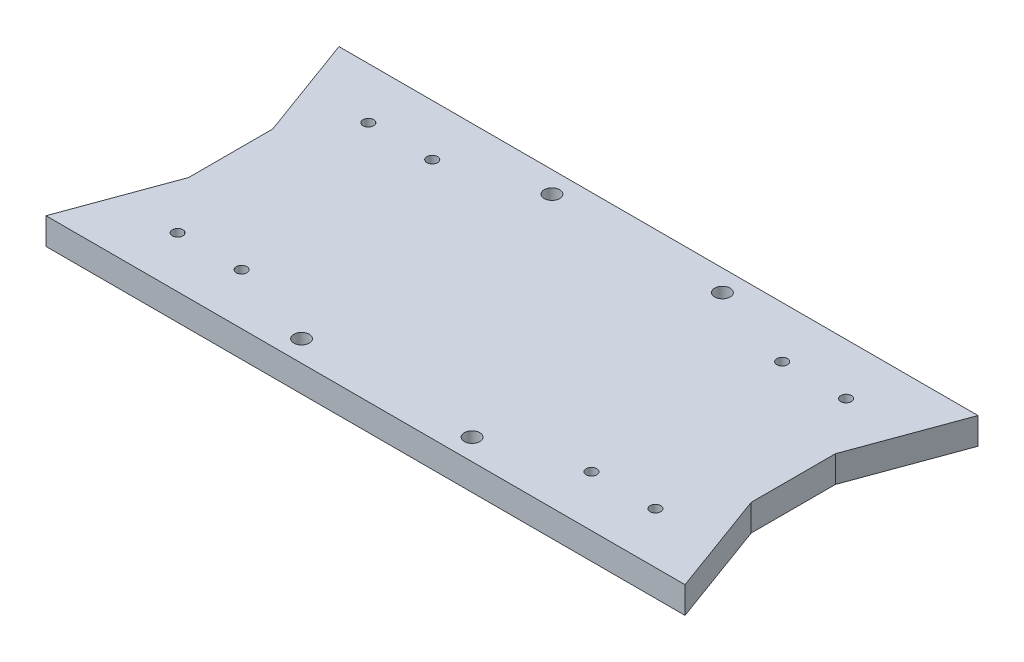
ISO-10303-21;
HEADER;
FILE_DESCRIPTION(('STEP AP214'),'2;1');
FILE_NAME('part.step','',(''),(''),'','','');
FILE_SCHEMA(('AUTOMOTIVE_DESIGN { 1 0 10303 214 1 1 1 1 }'));
ENDSEC;
DATA;
#1=APPLICATION_CONTEXT('core data for automotive mechanical design processes');
#2=APPLICATION_PROTOCOL_DEFINITION('international standard','automotive_design',2000,#1);
#3=PRODUCT_CONTEXT('',#1,'mechanical');
#4=PRODUCT('Part','Part','',(#3));
#5=PRODUCT_RELATED_PRODUCT_CATEGORY('part','',(#4));
#6=PRODUCT_DEFINITION_FORMATION('','',#4);
#7=PRODUCT_DEFINITION_CONTEXT('part definition',#1,'design');
#8=PRODUCT_DEFINITION('design','',#6,#7);
#9=PRODUCT_DEFINITION_SHAPE('','',#8);
#10=(LENGTH_UNIT() NAMED_UNIT(*) SI_UNIT(.MILLI.,.METRE.));
#11=(NAMED_UNIT(*) PLANE_ANGLE_UNIT() SI_UNIT($,.RADIAN.));
#12=(NAMED_UNIT(*) SI_UNIT($,.STERADIAN.) SOLID_ANGLE_UNIT());
#13=UNCERTAINTY_MEASURE_WITH_UNIT(LENGTH_MEASURE(1.E-05),#10,'distance_accuracy_value','');
#14=(GEOMETRIC_REPRESENTATION_CONTEXT(3) GLOBAL_UNCERTAINTY_ASSIGNED_CONTEXT((#13)) GLOBAL_UNIT_ASSIGNED_CONTEXT((#10,
#11,#12)) REPRESENTATION_CONTEXT('',''));
#15=CARTESIAN_POINT('',(0.,0.,0.));
#16=DIRECTION('',(0.,0.,1.));
#17=DIRECTION('',(1.,0.,0.));
#18=AXIS2_PLACEMENT_3D('',#15,#16,#17);
#19=CARTESIAN_POINT('',(-105.394952442636,6.35,-32.7826613509761));
#20=DIRECTION('',(-1.,0.,0.));
#21=DIRECTION('',(0.,0.,1.));
#22=AXIS2_PLACEMENT_3D('',#19,#20,#21);
#23=PLANE('',#22);
#24=DIRECTION('',(0.,0.,1.));
#25=VECTOR('',#24,1.);
#26=CARTESIAN_POINT('',(-105.394952442636,6.35,-32.7826613509761));
#27=LINE('',#26,#25);
#28=CARTESIAN_POINT('',(-105.394952442636,6.35,-77.7376613569761));
#29=VERTEX_POINT('',#28);
#30=CARTESIAN_POINT('',(-105.394952442636,6.35,-57.6776613449761));
#31=VERTEX_POINT('',#30);
#32=EDGE_CURVE('E99',#29,#31,#27,.T.);
#33=ORIENTED_EDGE('',*,*,#32,.F.);
#34=DIRECTION('',(0.,1.,0.));
#35=VECTOR('',#34,1.);
#36=CARTESIAN_POINT('',(-105.394952442636,0.,-77.7376613569761));
#37=LINE('',#36,#35);
#38=CARTESIAN_POINT('',(-105.394952442636,0.,-77.7376613569761));
#39=VERTEX_POINT('',#38);
#40=EDGE_CURVE('E128',#39,#29,#37,.T.);
#41=ORIENTED_EDGE('',*,*,#40,.F.);
#42=DIRECTION('',(0.,0.,-1.));
#43=VECTOR('',#42,1.);
#44=CARTESIAN_POINT('',(-105.394952442636,0.,-32.7826613509761));
#45=LINE('',#44,#43);
#46=CARTESIAN_POINT('',(-105.394952442636,0.,-57.6776613449761));
#47=VERTEX_POINT('',#46);
#48=EDGE_CURVE('E51',#47,#39,#45,.T.);
#49=ORIENTED_EDGE('',*,*,#48,.F.);
#50=DIRECTION('',(0.,1.,0.));
#51=VECTOR('',#50,1.);
#52=CARTESIAN_POINT('',(-105.394952442636,0.,-57.6776613449761));
#53=LINE('',#52,#51);
#54=EDGE_CURVE('E110',#47,#31,#53,.T.);
#55=ORIENTED_EDGE('',*,*,#54,.T.);
#56=EDGE_LOOP('',(#33,#41,#49,#55));
#57=FACE_BOUND('',#56,.T.);
#58=ADVANCED_FACE('F34',(#57),#23,.T.);
#59=CARTESIAN_POINT('',(0.,6.35,0.));
#60=DIRECTION('',(0.,-1.,0.));
#61=DIRECTION('',(0.,0.,-1.));
#62=AXIS2_PLACEMENT_3D('',#59,#60,#61);
#63=PLANE('',#62);
#64=CARTESIAN_POINT('',(-58.653665481045,6.35,-37.8626613509761));
#65=DIRECTION('',(0.,1.,0.));
#66=DIRECTION('',(0.,0.,1.));
#67=AXIS2_PLACEMENT_3D('',#64,#65,#66);
#68=CIRCLE('',#67,1.8415);
#69=CARTESIAN_POINT('',(-58.653665481045,6.35,-36.0211613509761));
#70=VERTEX_POINT('',#69);
#71=EDGE_CURVE('E446',#70,#70,#68,.T.);
#72=ORIENTED_EDGE('',*,*,#71,.F.);
#73=EDGE_LOOP('',(#72));
#74=FACE_BOUND('',#73,.T.);
#75=CARTESIAN_POINT('',(-18.013665481045,6.35,-37.8626613509761));
#76=DIRECTION('',(0.,1.,0.));
#77=DIRECTION('',(0.,0.,1.));
#78=AXIS2_PLACEMENT_3D('',#75,#76,#77);
#79=CIRCLE('',#78,1.8415);
#80=CARTESIAN_POINT('',(-18.013665481045,6.35,-36.0211613509761));
#81=VERTEX_POINT('',#80);
#82=EDGE_CURVE('E443',#81,#81,#79,.T.);
#83=ORIENTED_EDGE('',*,*,#82,.F.);
#84=EDGE_LOOP('',(#83));
#85=FACE_BOUND('',#84,.T.);
#86=CARTESIAN_POINT('',(-18.0136654810451,6.35,-97.552661350976));
#87=DIRECTION('',(0.,1.,0.));
#88=DIRECTION('',(0.,0.,1.));
#89=AXIS2_PLACEMENT_3D('',#86,#87,#88);
#90=CIRCLE('',#89,1.84149999999999);
#91=CARTESIAN_POINT('',(-18.0136654810451,6.35,-95.711161350976));
#92=VERTEX_POINT('',#91);
#93=EDGE_CURVE('E445',#92,#92,#90,.T.);
#94=ORIENTED_EDGE('',*,*,#93,.F.);
#95=EDGE_LOOP('',(#94));
#96=FACE_BOUND('',#95,.T.);
#97=CARTESIAN_POINT('',(-58.6536654810451,6.35,-97.552661350976));
#98=DIRECTION('',(0.,1.,0.));
#99=DIRECTION('',(0.,0.,1.));
#100=AXIS2_PLACEMENT_3D('',#97,#98,#99);
#101=CIRCLE('',#100,1.84149999999999);
#102=CARTESIAN_POINT('',(-58.6536654810451,6.35,-95.711161350976));
#103=VERTEX_POINT('',#102);
#104=EDGE_CURVE('E215',#103,#103,#101,.T.);
#105=ORIENTED_EDGE('',*,*,#104,.F.);
#106=EDGE_LOOP('',(#105));
#107=FACE_BOUND('',#106,.T.);
#108=ORIENTED_EDGE('',*,*,#32,.T.);
#109=DIRECTION('',(0.343774305183413,0.,-0.939052302641158));
#110=VECTOR('',#109,1.);
#111=CARTESIAN_POINT('',(-105.394952442636,6.35,-57.6776613449761));
#112=LINE('',#111,#110);
#113=CARTESIAN_POINT('',(-114.508674118636,6.35,-32.7826613509761));
#114=VERTEX_POINT('',#113);
#115=EDGE_CURVE('E103',#114,#31,#112,.T.);
#116=ORIENTED_EDGE('',*,*,#115,.F.);
#117=DIRECTION('',(1.,0.,0.));
#118=VECTOR('',#117,1.);
#119=CARTESIAN_POINT('',(-38.3336654810452,6.35,-32.7826613509761));
#120=LINE('',#119,#118);
#121=CARTESIAN_POINT('',(37.8413431565453,6.35,-32.7826613509761));
#122=VERTEX_POINT('',#121);
#123=EDGE_CURVE('E43',#114,#122,#120,.T.);
#124=ORIENTED_EDGE('',*,*,#123,.T.);
#125=DIRECTION('',(-0.343774305183413,0.,-0.939052302641158));
#126=VECTOR('',#125,1.);
#127=CARTESIAN_POINT('',(28.7276214805453,6.35,-57.6776613449761));
#128=LINE('',#127,#126);
#129=CARTESIAN_POINT('',(28.7276214805453,6.35,-57.6776613449761));
#130=VERTEX_POINT('',#129);
#131=EDGE_CURVE('E157',#122,#130,#128,.T.);
#132=ORIENTED_EDGE('',*,*,#131,.T.);
#133=DIRECTION('',(0.,0.,1.));
#134=VECTOR('',#133,1.);
#135=CARTESIAN_POINT('',(28.7276214805453,6.35,-32.7826613509761));
#136=LINE('',#135,#134);
#137=CARTESIAN_POINT('',(28.7276214805453,6.35,-77.7376613569761));
#138=VERTEX_POINT('',#137);
#139=EDGE_CURVE('E107',#138,#130,#136,.T.);
#140=ORIENTED_EDGE('',*,*,#139,.F.);
#141=DIRECTION('',(0.343774305183414,0.,-0.939052302641158));
#142=VECTOR('',#141,1.);
#143=CARTESIAN_POINT('',(37.8413431565453,6.35,-102.632661350976));
#144=LINE('',#143,#142);
#145=CARTESIAN_POINT('',(37.8413431565453,6.35,-102.632661350976));
#146=VERTEX_POINT('',#145);
#147=EDGE_CURVE('E166',#138,#146,#144,.T.);
#148=ORIENTED_EDGE('',*,*,#147,.T.);
#149=DIRECTION('',(-1.,0.,0.));
#150=VECTOR('',#149,1.);
#151=CARTESIAN_POINT('',(-38.3336654810452,6.35,-102.632661350976));
#152=LINE('',#151,#150);
#153=CARTESIAN_POINT('',(-114.508674118636,6.35,-102.632661350976));
#154=VERTEX_POINT('',#153);
#155=EDGE_CURVE('E11',#146,#154,#152,.T.);
#156=ORIENTED_EDGE('',*,*,#155,.T.);
#157=DIRECTION('',(-0.343774305183414,0.,-0.939052302641158));
#158=VECTOR('',#157,1.);
#159=CARTESIAN_POINT('',(-114.508674118636,6.35,-102.632661350976));
#160=LINE('',#159,#158);
#161=EDGE_CURVE('E105',#29,#154,#160,.T.);
#162=ORIENTED_EDGE('',*,*,#161,.F.);
#163=EDGE_LOOP('',(#108,#116,#124,#132,#140,#148,#156,#162));
#164=FACE_BOUND('',#163,.T.);
#165=CARTESIAN_POINT('',(18.6213431565454,6.35,-44.9476613509761));
#166=DIRECTION('',(0.,1.,0.));
#167=DIRECTION('',(0.,0.,1.));
#168=AXIS2_PLACEMENT_3D('',#165,#166,#167);
#169=CIRCLE('',#168,1.27);
#170=CARTESIAN_POINT('',(18.6213431565454,6.35,-43.6776613509761));
#171=VERTEX_POINT('',#170);
#172=EDGE_CURVE('E181',#171,#171,#169,.T.);
#173=ORIENTED_EDGE('',*,*,#172,.F.);
#174=EDGE_LOOP('',(#173));
#175=FACE_BOUND('',#174,.T.);
#176=CARTESIAN_POINT('',(3.38134315654538,6.35,-44.9476613509761));
#177=DIRECTION('',(0.,1.,0.));
#178=DIRECTION('',(0.,0.,1.));
#179=AXIS2_PLACEMENT_3D('',#176,#177,#178);
#180=CIRCLE('',#179,1.27);
#181=CARTESIAN_POINT('',(3.38134315654538,6.35,-43.6776613509761));
#182=VERTEX_POINT('',#181);
#183=EDGE_CURVE('E187',#182,#182,#180,.T.);
#184=ORIENTED_EDGE('',*,*,#183,.F.);
#185=EDGE_LOOP('',(#184));
#186=FACE_BOUND('',#185,.T.);
#187=CARTESIAN_POINT('',(18.6213431565454,6.35,-90.4076613509761));
#188=DIRECTION('',(0.,1.,0.));
#189=DIRECTION('',(0.,0.,1.));
#190=AXIS2_PLACEMENT_3D('',#187,#188,#189);
#191=CIRCLE('',#190,1.27000000000001);
#192=CARTESIAN_POINT('',(18.6213431565454,6.35,-89.137661350976));
#193=VERTEX_POINT('',#192);
#194=EDGE_CURVE('E193',#193,#193,#191,.T.);
#195=ORIENTED_EDGE('',*,*,#194,.F.);
#196=EDGE_LOOP('',(#195));
#197=FACE_BOUND('',#196,.T.);
#198=CARTESIAN_POINT('',(3.38134315654538,6.35,-90.4076613509761));
#199=DIRECTION('',(0.,1.,0.));
#200=DIRECTION('',(0.,0.,1.));
#201=AXIS2_PLACEMENT_3D('',#198,#199,#200);
#202=CIRCLE('',#201,1.27000000000001);
#203=CARTESIAN_POINT('',(3.38134315654538,6.35,-89.137661350976));
#204=VERTEX_POINT('',#203);
#205=EDGE_CURVE('E199',#204,#204,#202,.T.);
#206=ORIENTED_EDGE('',*,*,#205,.F.);
#207=EDGE_LOOP('',(#206));
#208=FACE_BOUND('',#207,.T.);
#209=CARTESIAN_POINT('',(-95.2886741186358,6.35,-44.9476613509761));
#210=DIRECTION('',(0.,-1.,0.));
#211=DIRECTION('',(0.,0.,1.));
#212=AXIS2_PLACEMENT_3D('',#209,#210,#211);
#213=CIRCLE('',#212,1.27);
#214=CARTESIAN_POINT('',(-95.2886741186358,6.35,-43.6776613509761));
#215=VERTEX_POINT('',#214);
#216=EDGE_CURVE('E133',#215,#215,#213,.T.);
#217=ORIENTED_EDGE('',*,*,#216,.T.);
#218=EDGE_LOOP('',(#217));
#219=FACE_BOUND('',#218,.T.);
#220=CARTESIAN_POINT('',(-80.0486741186358,6.35,-44.9476613509761));
#221=DIRECTION('',(0.,-1.,0.));
#222=DIRECTION('',(0.,0.,1.));
#223=AXIS2_PLACEMENT_3D('',#220,#221,#222);
#224=CIRCLE('',#223,1.27);
#225=CARTESIAN_POINT('',(-80.0486741186358,6.35,-43.6776613509761));
#226=VERTEX_POINT('',#225);
#227=EDGE_CURVE('E139',#226,#226,#224,.T.);
#228=ORIENTED_EDGE('',*,*,#227,.T.);
#229=EDGE_LOOP('',(#228));
#230=FACE_BOUND('',#229,.T.);
#231=CARTESIAN_POINT('',(-95.2886741186358,6.35,-90.4076613509761));
#232=DIRECTION('',(0.,-1.,0.));
#233=DIRECTION('',(0.,0.,1.));
#234=AXIS2_PLACEMENT_3D('',#231,#232,#233);
#235=CIRCLE('',#234,1.27000000000001);
#236=CARTESIAN_POINT('',(-95.2886741186358,6.35,-89.137661350976));
#237=VERTEX_POINT('',#236);
#238=EDGE_CURVE('E145',#237,#237,#235,.T.);
#239=ORIENTED_EDGE('',*,*,#238,.T.);
#240=EDGE_LOOP('',(#239));
#241=FACE_BOUND('',#240,.T.);
#242=CARTESIAN_POINT('',(-80.0486741186358,6.35,-90.4076613509761));
#243=DIRECTION('',(0.,-1.,0.));
#244=DIRECTION('',(0.,0.,1.));
#245=AXIS2_PLACEMENT_3D('',#242,#243,#244);
#246=CIRCLE('',#245,1.27000000000001);
#247=CARTESIAN_POINT('',(-80.0486741186358,6.35,-89.137661350976));
#248=VERTEX_POINT('',#247);
#249=EDGE_CURVE('E151',#248,#248,#246,.T.);
#250=ORIENTED_EDGE('',*,*,#249,.T.);
#251=EDGE_LOOP('',(#250));
#252=FACE_BOUND('',#251,.T.);
#253=ADVANCED_FACE('F100',(#74,#85,#96,#107,#164,#175,#186,#197,#208,#219,#230,#241,#252),#63,.F.);
#254=CARTESIAN_POINT('',(0.,0.,0.));
#255=DIRECTION('',(0.,-1.,0.));
#256=DIRECTION('',(0.,0.,-1.));
#257=AXIS2_PLACEMENT_3D('',#254,#255,#256);
#258=PLANE('',#257);
#259=CARTESIAN_POINT('',(-58.653665481045,0.,-37.8626613509761));
#260=DIRECTION('',(0.,-1.,0.));
#261=DIRECTION('',(0.,0.,-1.));
#262=AXIS2_PLACEMENT_3D('',#259,#260,#261);
#263=CIRCLE('',#262,1.8415);
#264=CARTESIAN_POINT('',(-58.653665481045,0.,-39.7041613509761));
#265=VERTEX_POINT('',#264);
#266=EDGE_CURVE('E38',#265,#265,#263,.T.);
#267=ORIENTED_EDGE('',*,*,#266,.F.);
#268=EDGE_LOOP('',(#267));
#269=FACE_BOUND('',#268,.T.);
#270=CARTESIAN_POINT('',(-18.013665481045,0.,-37.8626613509761));
#271=DIRECTION('',(0.,-1.,0.));
#272=DIRECTION('',(0.,0.,-1.));
#273=AXIS2_PLACEMENT_3D('',#270,#271,#272);
#274=CIRCLE('',#273,1.8415);
#275=CARTESIAN_POINT('',(-18.013665481045,0.,-39.7041613509761));
#276=VERTEX_POINT('',#275);
#277=EDGE_CURVE('E217',#276,#276,#274,.T.);
#278=ORIENTED_EDGE('',*,*,#277,.F.);
#279=EDGE_LOOP('',(#278));
#280=FACE_BOUND('',#279,.T.);
#281=CARTESIAN_POINT('',(-18.0136654810451,0.,-97.552661350976));
#282=DIRECTION('',(0.,-1.,0.));
#283=DIRECTION('',(0.,0.,-1.));
#284=AXIS2_PLACEMENT_3D('',#281,#282,#283);
#285=CIRCLE('',#284,1.84149999999999);
#286=CARTESIAN_POINT('',(-18.0136654810451,0.,-99.394161350976));
#287=VERTEX_POINT('',#286);
#288=EDGE_CURVE('E214',#287,#287,#285,.T.);
#289=ORIENTED_EDGE('',*,*,#288,.F.);
#290=EDGE_LOOP('',(#289));
#291=FACE_BOUND('',#290,.T.);
#292=CARTESIAN_POINT('',(-58.6536654810451,0.,-97.552661350976));
#293=DIRECTION('',(0.,-1.,0.));
#294=DIRECTION('',(0.,0.,-1.));
#295=AXIS2_PLACEMENT_3D('',#292,#293,#294);
#296=CIRCLE('',#295,1.84149999999999);
#297=CARTESIAN_POINT('',(-58.6536654810451,0.,-99.394161350976));
#298=VERTEX_POINT('',#297);
#299=EDGE_CURVE('E211',#298,#298,#296,.T.);
#300=ORIENTED_EDGE('',*,*,#299,.F.);
#301=EDGE_LOOP('',(#300));
#302=FACE_BOUND('',#301,.T.);
#303=CARTESIAN_POINT('',(3.38134315654538,0.,-44.9476613509761));
#304=DIRECTION('',(0.,1.,0.));
#305=DIRECTION('',(0.,0.,1.));
#306=AXIS2_PLACEMENT_3D('',#303,#304,#305);
#307=CIRCLE('',#306,1.27);
#308=CARTESIAN_POINT('',(3.38134315654538,0.,-43.6776613509761));
#309=VERTEX_POINT('',#308);
#310=EDGE_CURVE('E184',#309,#309,#307,.T.);
#311=ORIENTED_EDGE('',*,*,#310,.T.);
#312=EDGE_LOOP('',(#311));
#313=FACE_BOUND('',#312,.T.);
#314=CARTESIAN_POINT('',(3.38134315654538,0.,-90.4076613509761));
#315=DIRECTION('',(0.,1.,0.));
#316=DIRECTION('',(0.,0.,1.));
#317=AXIS2_PLACEMENT_3D('',#314,#315,#316);
#318=CIRCLE('',#317,1.27000000000001);
#319=CARTESIAN_POINT('',(3.38134315654538,0.,-89.137661350976));
#320=VERTEX_POINT('',#319);
#321=EDGE_CURVE('E196',#320,#320,#318,.T.);
#322=ORIENTED_EDGE('',*,*,#321,.T.);
#323=EDGE_LOOP('',(#322));
#324=FACE_BOUND('',#323,.T.);
#325=DIRECTION('',(1.,0.,0.));
#326=VECTOR('',#325,1.);
#327=CARTESIAN_POINT('',(-38.3336654810452,0.,-32.7826613509761));
#328=LINE('',#327,#326);
#329=CARTESIAN_POINT('',(-114.508674118636,0.,-32.7826613509761));
#330=VERTEX_POINT('',#329);
#331=CARTESIAN_POINT('',(37.8413431565453,0.,-32.7826613509761));
#332=VERTEX_POINT('',#331);
#333=EDGE_CURVE('E202',#330,#332,#328,.T.);
#334=ORIENTED_EDGE('',*,*,#333,.F.);
#335=DIRECTION('',(0.343774305183413,0.,-0.939052302641158));
#336=VECTOR('',#335,1.);
#337=CARTESIAN_POINT('',(-105.394952442636,0.,-57.6776613449761));
#338=LINE('',#337,#336);
#339=EDGE_CURVE('E114',#330,#47,#338,.T.);
#340=ORIENTED_EDGE('',*,*,#339,.T.);
#341=ORIENTED_EDGE('',*,*,#48,.T.);
#342=DIRECTION('',(-0.343774305183414,0.,-0.939052302641158));
#343=VECTOR('',#342,1.);
#344=CARTESIAN_POINT('',(-114.508674118636,0.,-102.632661350976));
#345=LINE('',#344,#343);
#346=CARTESIAN_POINT('',(-114.508674118636,0.,-102.632661350976));
#347=VERTEX_POINT('',#346);
#348=EDGE_CURVE('E124',#39,#347,#345,.T.);
#349=ORIENTED_EDGE('',*,*,#348,.T.);
#350=DIRECTION('',(-1.,0.,0.));
#351=VECTOR('',#350,1.);
#352=CARTESIAN_POINT('',(-38.3336654810452,0.,-102.632661350976));
#353=LINE('',#352,#351);
#354=CARTESIAN_POINT('',(37.8413431565453,0.,-102.632661350976));
#355=VERTEX_POINT('',#354);
#356=EDGE_CURVE('E205',#355,#347,#353,.T.);
#357=ORIENTED_EDGE('',*,*,#356,.F.);
#358=DIRECTION('',(0.343774305183414,0.,-0.939052302641158));
#359=VECTOR('',#358,1.);
#360=CARTESIAN_POINT('',(37.8413431565453,0.,-102.632661350976));
#361=LINE('',#360,#359);
#362=CARTESIAN_POINT('',(28.7276214805453,0.,-77.7376613569761));
#363=VERTEX_POINT('',#362);
#364=EDGE_CURVE('E169',#363,#355,#361,.T.);
#365=ORIENTED_EDGE('',*,*,#364,.F.);
#366=DIRECTION('',(0.,0.,-1.));
#367=VECTOR('',#366,1.);
#368=CARTESIAN_POINT('',(28.7276214805453,0.,-32.7826613509761));
#369=LINE('',#368,#367);
#370=CARTESIAN_POINT('',(28.7276214805453,0.,-57.6776613449761));
#371=VERTEX_POINT('',#370);
#372=EDGE_CURVE('E208',#371,#363,#369,.T.);
#373=ORIENTED_EDGE('',*,*,#372,.F.);
#374=DIRECTION('',(-0.343774305183413,0.,-0.939052302641158));
#375=VECTOR('',#374,1.);
#376=CARTESIAN_POINT('',(28.7276214805453,0.,-57.6776613449761));
#377=LINE('',#376,#375);
#378=EDGE_CURVE('E158',#332,#371,#377,.T.);
#379=ORIENTED_EDGE('',*,*,#378,.F.);
#380=EDGE_LOOP('',(#334,#340,#341,#349,#357,#365,#373,#379));
#381=FACE_BOUND('',#380,.T.);
#382=CARTESIAN_POINT('',(18.6213431565454,0.,-90.4076613509761));
#383=DIRECTION('',(0.,1.,0.));
#384=DIRECTION('',(0.,0.,1.));
#385=AXIS2_PLACEMENT_3D('',#382,#383,#384);
#386=CIRCLE('',#385,1.27000000000001);
#387=CARTESIAN_POINT('',(18.6213431565454,0.,-89.137661350976));
#388=VERTEX_POINT('',#387);
#389=EDGE_CURVE('E190',#388,#388,#386,.T.);
#390=ORIENTED_EDGE('',*,*,#389,.T.);
#391=EDGE_LOOP('',(#390));
#392=FACE_BOUND('',#391,.T.);
#393=CARTESIAN_POINT('',(18.6213431565454,0.,-44.9476613509761));
#394=DIRECTION('',(0.,1.,0.));
#395=DIRECTION('',(0.,0.,1.));
#396=AXIS2_PLACEMENT_3D('',#393,#394,#395);
#397=CIRCLE('',#396,1.27);
#398=CARTESIAN_POINT('',(18.6213431565454,0.,-43.6776613509761));
#399=VERTEX_POINT('',#398);
#400=EDGE_CURVE('E178',#399,#399,#397,.T.);
#401=ORIENTED_EDGE('',*,*,#400,.T.);
#402=EDGE_LOOP('',(#401));
#403=FACE_BOUND('',#402,.T.);
#404=CARTESIAN_POINT('',(-95.2886741186358,0.,-44.9476613509761));
#405=DIRECTION('',(0.,-1.,0.));
#406=DIRECTION('',(0.,0.,1.));
#407=AXIS2_PLACEMENT_3D('',#404,#405,#406);
#408=CIRCLE('',#407,1.27);
#409=CARTESIAN_POINT('',(-95.2886741186358,0.,-43.6776613509761));
#410=VERTEX_POINT('',#409);
#411=EDGE_CURVE('E130',#410,#410,#408,.T.);
#412=ORIENTED_EDGE('',*,*,#411,.F.);
#413=EDGE_LOOP('',(#412));
#414=FACE_BOUND('',#413,.T.);
#415=CARTESIAN_POINT('',(-80.0486741186358,0.,-44.9476613509761));
#416=DIRECTION('',(0.,-1.,0.));
#417=DIRECTION('',(0.,0.,1.));
#418=AXIS2_PLACEMENT_3D('',#415,#416,#417);
#419=CIRCLE('',#418,1.27);
#420=CARTESIAN_POINT('',(-80.0486741186358,0.,-43.6776613509761));
#421=VERTEX_POINT('',#420);
#422=EDGE_CURVE('E136',#421,#421,#419,.T.);
#423=ORIENTED_EDGE('',*,*,#422,.F.);
#424=EDGE_LOOP('',(#423));
#425=FACE_BOUND('',#424,.T.);
#426=CARTESIAN_POINT('',(-95.2886741186358,0.,-90.4076613509761));
#427=DIRECTION('',(0.,-1.,0.));
#428=DIRECTION('',(0.,0.,1.));
#429=AXIS2_PLACEMENT_3D('',#426,#427,#428);
#430=CIRCLE('',#429,1.27000000000001);
#431=CARTESIAN_POINT('',(-95.2886741186358,0.,-89.137661350976));
#432=VERTEX_POINT('',#431);
#433=EDGE_CURVE('E142',#432,#432,#430,.T.);
#434=ORIENTED_EDGE('',*,*,#433,.F.);
#435=EDGE_LOOP('',(#434));
#436=FACE_BOUND('',#435,.T.);
#437=CARTESIAN_POINT('',(-80.0486741186358,0.,-90.4076613509761));
#438=DIRECTION('',(0.,-1.,0.));
#439=DIRECTION('',(0.,0.,1.));
#440=AXIS2_PLACEMENT_3D('',#437,#438,#439);
#441=CIRCLE('',#440,1.27000000000001);
#442=CARTESIAN_POINT('',(-80.0486741186358,0.,-89.137661350976));
#443=VERTEX_POINT('',#442);
#444=EDGE_CURVE('E148',#443,#443,#441,.T.);
#445=ORIENTED_EDGE('',*,*,#444,.F.);
#446=EDGE_LOOP('',(#445));
#447=FACE_BOUND('',#446,.T.);
#448=ADVANCED_FACE('F227',(#269,#280,#291,#302,#313,#324,#381,#392,#403,#414,#425,#436,#447),
#258,.T.);
#449=CARTESIAN_POINT('',(-38.3336654810452,6.35,-32.7826613509761));
#450=DIRECTION('',(0.,0.,-1.));
#451=DIRECTION('',(-1.,0.,0.));
#452=AXIS2_PLACEMENT_3D('',#449,#450,#451);
#453=PLANE('',#452);
#454=ORIENTED_EDGE('',*,*,#333,.T.);
#455=DIRECTION('',(0.,1.,0.));
#456=VECTOR('',#455,1.);
#457=CARTESIAN_POINT('',(37.8413431565453,0.,-32.7826613509761));
#458=LINE('',#457,#456);
#459=EDGE_CURVE('E160',#332,#122,#458,.T.);
#460=ORIENTED_EDGE('',*,*,#459,.T.);
#461=ORIENTED_EDGE('',*,*,#123,.F.);
#462=DIRECTION('',(0.,1.,0.));
#463=VECTOR('',#462,1.);
#464=CARTESIAN_POINT('',(-114.508674118636,0.,-32.7826613509761));
#465=LINE('',#464,#463);
#466=EDGE_CURVE('E113',#330,#114,#465,.T.);
#467=ORIENTED_EDGE('',*,*,#466,.F.);
#468=EDGE_LOOP('',(#454,#460,#461,#467));
#469=FACE_BOUND('',#468,.T.);
#470=ADVANCED_FACE('F36',(#469),#453,.F.);
#471=CARTESIAN_POINT('',(28.7276214805453,6.35,-32.7826613509761));
#472=DIRECTION('',(-1.,0.,0.));
#473=DIRECTION('',(0.,0.,1.));
#474=AXIS2_PLACEMENT_3D('',#471,#472,#473);
#475=PLANE('',#474);
#476=DIRECTION('',(0.,1.,0.));
#477=VECTOR('',#476,1.);
#478=CARTESIAN_POINT('',(28.7276214805453,0.,-77.7376613569761));
#479=LINE('',#478,#477);
#480=EDGE_CURVE('E172',#363,#138,#479,.T.);
#481=ORIENTED_EDGE('',*,*,#480,.T.);
#482=ORIENTED_EDGE('',*,*,#139,.T.);
#483=DIRECTION('',(0.,1.,0.));
#484=VECTOR('',#483,1.);
#485=CARTESIAN_POINT('',(28.7276214805453,0.,-57.6776613449761));
#486=LINE('',#485,#484);
#487=EDGE_CURVE('E163',#371,#130,#486,.T.);
#488=ORIENTED_EDGE('',*,*,#487,.F.);
#489=ORIENTED_EDGE('',*,*,#372,.T.);
#490=EDGE_LOOP('',(#481,#482,#488,#489));
#491=FACE_BOUND('',#490,.T.);
#492=ADVANCED_FACE('F299',(#491),#475,.F.);
#493=CARTESIAN_POINT('',(-38.3336654810452,6.35,-102.632661350976));
#494=DIRECTION('',(0.,0.,1.));
#495=DIRECTION('',(1.,0.,0.));
#496=AXIS2_PLACEMENT_3D('',#493,#494,#495);
#497=PLANE('',#496);
#498=ORIENTED_EDGE('',*,*,#356,.T.);
#499=DIRECTION('',(0.,1.,0.));
#500=VECTOR('',#499,1.);
#501=CARTESIAN_POINT('',(-114.508674118636,0.,-102.632661350976));
#502=LINE('',#501,#500);
#503=EDGE_CURVE('E126',#347,#154,#502,.T.);
#504=ORIENTED_EDGE('',*,*,#503,.T.);
#505=ORIENTED_EDGE('',*,*,#155,.F.);
#506=DIRECTION('',(0.,1.,0.));
#507=VECTOR('',#506,1.);
#508=CARTESIAN_POINT('',(37.8413431565453,0.,-102.632661350976));
#509=LINE('',#508,#507);
#510=EDGE_CURVE('E175',#355,#146,#509,.T.);
#511=ORIENTED_EDGE('',*,*,#510,.F.);
#512=EDGE_LOOP('',(#498,#504,#505,#511));
#513=FACE_BOUND('',#512,.T.);
#514=ADVANCED_FACE('F295',(#513),#497,.F.);
#515=CARTESIAN_POINT('',(3.38134315654538,6.35,-90.4076613509761));
#516=DIRECTION('',(0.,-1.,0.));
#517=DIRECTION('',(0.,0.,-1.));
#518=AXIS2_PLACEMENT_3D('',#515,#516,#517);
#519=CYLINDRICAL_SURFACE('',#518,1.27000000000001);
#520=ORIENTED_EDGE('',*,*,#205,.T.);
#521=EDGE_LOOP('',(#520));
#522=FACE_BOUND('',#521,.T.);
#523=ORIENTED_EDGE('',*,*,#321,.F.);
#524=EDGE_LOOP('',(#523));
#525=FACE_BOUND('',#524,.T.);
#526=ADVANCED_FACE('F292',(#522,#525),#519,.F.);
#527=CARTESIAN_POINT('',(18.6213431565454,6.35,-90.4076613509761));
#528=DIRECTION('',(0.,-1.,0.));
#529=DIRECTION('',(0.,0.,-1.));
#530=AXIS2_PLACEMENT_3D('',#527,#528,#529);
#531=CYLINDRICAL_SURFACE('',#530,1.27000000000001);
#532=ORIENTED_EDGE('',*,*,#194,.T.);
#533=EDGE_LOOP('',(#532));
#534=FACE_BOUND('',#533,.T.);
#535=ORIENTED_EDGE('',*,*,#389,.F.);
#536=EDGE_LOOP('',(#535));
#537=FACE_BOUND('',#536,.T.);
#538=ADVANCED_FACE('F288',(#534,#537),#531,.F.);
#539=CARTESIAN_POINT('',(3.38134315654538,6.35,-44.9476613509761));
#540=DIRECTION('',(0.,-1.,0.));
#541=DIRECTION('',(0.,0.,-1.));
#542=AXIS2_PLACEMENT_3D('',#539,#540,#541);
#543=CYLINDRICAL_SURFACE('',#542,1.27);
#544=ORIENTED_EDGE('',*,*,#183,.T.);
#545=EDGE_LOOP('',(#544));
#546=FACE_BOUND('',#545,.T.);
#547=ORIENTED_EDGE('',*,*,#310,.F.);
#548=EDGE_LOOP('',(#547));
#549=FACE_BOUND('',#548,.T.);
#550=ADVANCED_FACE('F284',(#546,#549),#543,.F.);
#551=CARTESIAN_POINT('',(18.6213431565454,6.35,-44.9476613509761));
#552=DIRECTION('',(0.,-1.,0.));
#553=DIRECTION('',(0.,0.,-1.));
#554=AXIS2_PLACEMENT_3D('',#551,#552,#553);
#555=CYLINDRICAL_SURFACE('',#554,1.27);
#556=ORIENTED_EDGE('',*,*,#172,.T.);
#557=EDGE_LOOP('',(#556));
#558=FACE_BOUND('',#557,.T.);
#559=ORIENTED_EDGE('',*,*,#400,.F.);
#560=EDGE_LOOP('',(#559));
#561=FACE_BOUND('',#560,.T.);
#562=ADVANCED_FACE('F280',(#558,#561),#555,.F.);
#563=CARTESIAN_POINT('',(37.8413431565453,0.,-102.632661350976));
#564=DIRECTION('',(0.939052302641158,0.,0.343774305183414));
#565=DIRECTION('',(0.343774305183414,0.,-0.939052302641158));
#566=AXIS2_PLACEMENT_3D('',#563,#564,#565);
#567=PLANE('',#566);
#568=ORIENTED_EDGE('',*,*,#147,.F.);
#569=ORIENTED_EDGE('',*,*,#480,.F.);
#570=ORIENTED_EDGE('',*,*,#364,.T.);
#571=ORIENTED_EDGE('',*,*,#510,.T.);
#572=EDGE_LOOP('',(#568,#569,#570,#571));
#573=FACE_BOUND('',#572,.T.);
#574=ADVANCED_FACE('F266',(#573),#567,.T.);
#575=CARTESIAN_POINT('',(28.7276214805453,0.,-57.6776613449761));
#576=DIRECTION('',(0.939052302641158,0.,-0.343774305183413));
#577=DIRECTION('',(-0.343774305183413,0.,-0.939052302641158));
#578=AXIS2_PLACEMENT_3D('',#575,#576,#577);
#579=PLANE('',#578);
#580=ORIENTED_EDGE('',*,*,#131,.F.);
#581=ORIENTED_EDGE('',*,*,#459,.F.);
#582=ORIENTED_EDGE('',*,*,#378,.T.);
#583=ORIENTED_EDGE('',*,*,#487,.T.);
#584=EDGE_LOOP('',(#580,#581,#582,#583));
#585=FACE_BOUND('',#584,.T.);
#586=ADVANCED_FACE('F256',(#585),#579,.T.);
#587=CARTESIAN_POINT('',(-80.0486741186358,6.35,-90.4076613509761));
#588=DIRECTION('',(0.,-1.,0.));
#589=DIRECTION('',(0.,0.,-1.));
#590=AXIS2_PLACEMENT_3D('',#587,#588,#589);
#591=CYLINDRICAL_SURFACE('',#590,1.27000000000001);
#592=ORIENTED_EDGE('',*,*,#249,.F.);
#593=EDGE_LOOP('',(#592));
#594=FACE_BOUND('',#593,.T.);
#595=ORIENTED_EDGE('',*,*,#444,.T.);
#596=EDGE_LOOP('',(#595));
#597=FACE_BOUND('',#596,.T.);
#598=ADVANCED_FACE('F253',(#594,#597),#591,.F.);
#599=CARTESIAN_POINT('',(-95.2886741186358,6.35,-90.4076613509761));
#600=DIRECTION('',(0.,-1.,0.));
#601=DIRECTION('',(0.,0.,-1.));
#602=AXIS2_PLACEMENT_3D('',#599,#600,#601);
#603=CYLINDRICAL_SURFACE('',#602,1.27000000000001);
#604=ORIENTED_EDGE('',*,*,#238,.F.);
#605=EDGE_LOOP('',(#604));
#606=FACE_BOUND('',#605,.T.);
#607=ORIENTED_EDGE('',*,*,#433,.T.);
#608=EDGE_LOOP('',(#607));
#609=FACE_BOUND('',#608,.T.);
#610=ADVANCED_FACE('F255',(#606,#609),#603,.F.);
#611=CARTESIAN_POINT('',(-80.0486741186358,6.35,-44.9476613509761));
#612=DIRECTION('',(0.,-1.,0.));
#613=DIRECTION('',(0.,0.,-1.));
#614=AXIS2_PLACEMENT_3D('',#611,#612,#613);
#615=CYLINDRICAL_SURFACE('',#614,1.27);
#616=ORIENTED_EDGE('',*,*,#227,.F.);
#617=EDGE_LOOP('',(#616));
#618=FACE_BOUND('',#617,.T.);
#619=ORIENTED_EDGE('',*,*,#422,.T.);
#620=EDGE_LOOP('',(#619));
#621=FACE_BOUND('',#620,.T.);
#622=ADVANCED_FACE('F263',(#618,#621),#615,.F.);
#623=CARTESIAN_POINT('',(-95.2886741186358,6.35,-44.9476613509761));
#624=DIRECTION('',(0.,-1.,0.));
#625=DIRECTION('',(0.,0.,-1.));
#626=AXIS2_PLACEMENT_3D('',#623,#624,#625);
#627=CYLINDRICAL_SURFACE('',#626,1.27);
#628=ORIENTED_EDGE('',*,*,#216,.F.);
#629=EDGE_LOOP('',(#628));
#630=FACE_BOUND('',#629,.T.);
#631=ORIENTED_EDGE('',*,*,#411,.T.);
#632=EDGE_LOOP('',(#631));
#633=FACE_BOUND('',#632,.T.);
#634=ADVANCED_FACE('F320',(#630,#633),#627,.F.);
#635=CARTESIAN_POINT('',(-114.508674118636,0.,-102.632661350976));
#636=DIRECTION('',(0.939052302641158,0.,-0.343774305183414));
#637=DIRECTION('',(-0.343774305183414,0.,-0.939052302641158));
#638=AXIS2_PLACEMENT_3D('',#635,#636,#637);
#639=PLANE('',#638);
#640=ORIENTED_EDGE('',*,*,#161,.T.);
#641=ORIENTED_EDGE('',*,*,#503,.F.);
#642=ORIENTED_EDGE('',*,*,#348,.F.);
#643=ORIENTED_EDGE('',*,*,#40,.T.);
#644=EDGE_LOOP('',(#640,#641,#642,#643));
#645=FACE_BOUND('',#644,.T.);
#646=ADVANCED_FACE('F318',(#645),#639,.F.);
#647=CARTESIAN_POINT('',(-105.394952442636,0.,-57.6776613449761));
#648=DIRECTION('',(0.939052302641158,0.,0.343774305183413));
#649=DIRECTION('',(0.343774305183413,0.,-0.939052302641158));
#650=AXIS2_PLACEMENT_3D('',#647,#648,#649);
#651=PLANE('',#650);
#652=ORIENTED_EDGE('',*,*,#115,.T.);
#653=ORIENTED_EDGE('',*,*,#54,.F.);
#654=ORIENTED_EDGE('',*,*,#339,.F.);
#655=ORIENTED_EDGE('',*,*,#466,.T.);
#656=EDGE_LOOP('',(#652,#653,#654,#655));
#657=FACE_BOUND('',#656,.T.);
#658=ADVANCED_FACE('F117',(#657),#651,.F.);
#659=CARTESIAN_POINT('',(-58.6536654810451,-7.36600000000001,-97.552661350976));
#660=DIRECTION('',(0.,1.,0.));
#661=DIRECTION('',(0.,0.,1.));
#662=AXIS2_PLACEMENT_3D('',#659,#660,#661);
#663=CYLINDRICAL_SURFACE('',#662,1.84149999999999);
#664=ORIENTED_EDGE('',*,*,#299,.T.);
#665=EDGE_LOOP('',(#664));
#666=FACE_BOUND('',#665,.T.);
#667=ORIENTED_EDGE('',*,*,#104,.T.);
#668=EDGE_LOOP('',(#667));
#669=FACE_BOUND('',#668,.T.);
#670=ADVANCED_FACE('F326',(#666,#669),#663,.F.);
#671=CARTESIAN_POINT('',(-18.0136654810451,-7.36600000000001,-97.552661350976));
#672=DIRECTION('',(0.,1.,0.));
#673=DIRECTION('',(0.,0.,1.));
#674=AXIS2_PLACEMENT_3D('',#671,#672,#673);
#675=CYLINDRICAL_SURFACE('',#674,1.84149999999999);
#676=ORIENTED_EDGE('',*,*,#288,.T.);
#677=EDGE_LOOP('',(#676));
#678=FACE_BOUND('',#677,.T.);
#679=ORIENTED_EDGE('',*,*,#93,.T.);
#680=EDGE_LOOP('',(#679));
#681=FACE_BOUND('',#680,.T.);
#682=ADVANCED_FACE('F410',(#678,#681),#675,.F.);
#683=CARTESIAN_POINT('',(-18.013665481045,-7.36600000000001,-37.8626613509761));
#684=DIRECTION('',(0.,1.,0.));
#685=DIRECTION('',(0.,0.,1.));
#686=AXIS2_PLACEMENT_3D('',#683,#684,#685);
#687=CYLINDRICAL_SURFACE('',#686,1.8415);
#688=ORIENTED_EDGE('',*,*,#277,.T.);
#689=EDGE_LOOP('',(#688));
#690=FACE_BOUND('',#689,.T.);
#691=ORIENTED_EDGE('',*,*,#82,.T.);
#692=EDGE_LOOP('',(#691));
#693=FACE_BOUND('',#692,.T.);
#694=ADVANCED_FACE('F419',(#690,#693),#687,.F.);
#695=CARTESIAN_POINT('',(-58.653665481045,-7.36600000000001,-37.8626613509761));
#696=DIRECTION('',(0.,1.,0.));
#697=DIRECTION('',(0.,0.,1.));
#698=AXIS2_PLACEMENT_3D('',#695,#696,#697);
#699=CYLINDRICAL_SURFACE('',#698,1.8415);
#700=ORIENTED_EDGE('',*,*,#266,.T.);
#701=EDGE_LOOP('',(#700));
#702=FACE_BOUND('',#701,.T.);
#703=ORIENTED_EDGE('',*,*,#71,.T.);
#704=EDGE_LOOP('',(#703));
#705=FACE_BOUND('',#704,.T.);
#706=ADVANCED_FACE('F224',(#702,#705),#699,.F.);
#707=CLOSED_SHELL('',(#58,#253,#448,#470,#492,#514,#526,#538,#550,#562,#574,#586,#598,#610,#622,
#634,#646,#658,#670,#682,#694,#706));
#708=MANIFOLD_SOLID_BREP('B2',#707);
#709=ADVANCED_BREP_SHAPE_REPRESENTATION('',(#18,#708),#14);
#710=SHAPE_DEFINITION_REPRESENTATION(#9,#709);
ENDSEC;
END-ISO-10303-21;
